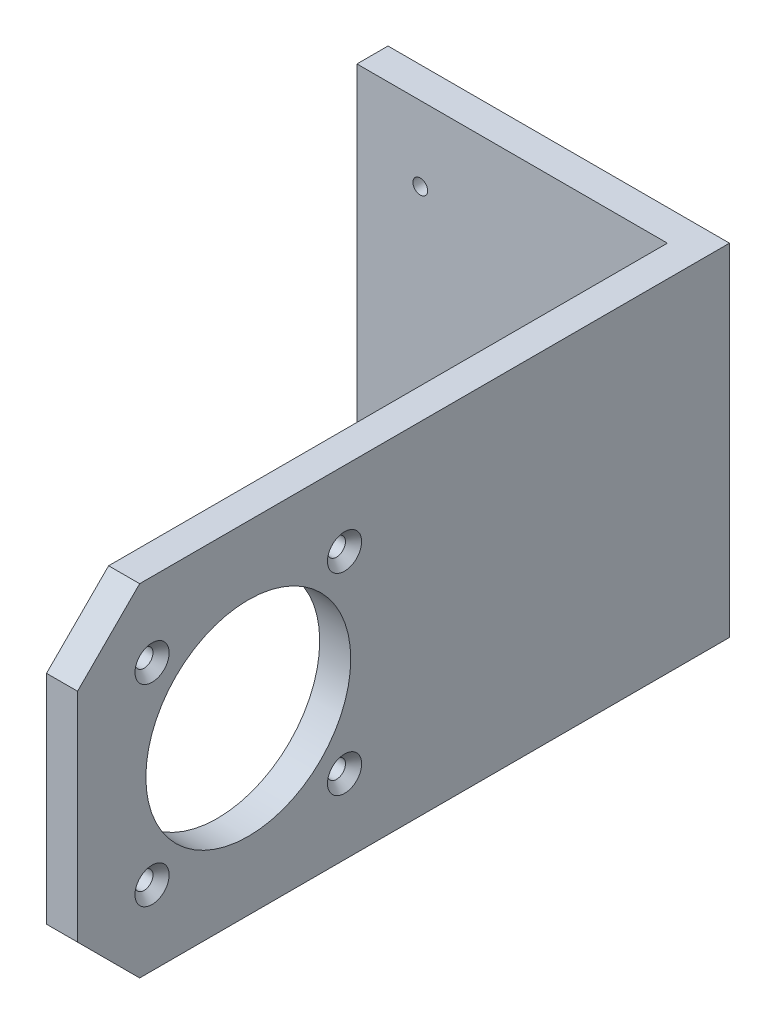
ISO-10303-21;
HEADER;
FILE_DESCRIPTION(('STEP AP214'),'2;1');
FILE_NAME('part.step','',(''),(''),'','','');
FILE_SCHEMA(('AUTOMOTIVE_DESIGN { 1 0 10303 214 1 1 1 1 }'));
ENDSEC;
DATA;
#1=APPLICATION_CONTEXT('core data for automotive mechanical design processes');
#2=APPLICATION_PROTOCOL_DEFINITION('international standard','automotive_design',2000,#1);
#3=PRODUCT_CONTEXT('',#1,'mechanical');
#4=PRODUCT('Part','Part','',(#3));
#5=PRODUCT_RELATED_PRODUCT_CATEGORY('part','',(#4));
#6=PRODUCT_DEFINITION_FORMATION('','',#4);
#7=PRODUCT_DEFINITION_CONTEXT('part definition',#1,'design');
#8=PRODUCT_DEFINITION('design','',#6,#7);
#9=PRODUCT_DEFINITION_SHAPE('','',#8);
#10=(LENGTH_UNIT() NAMED_UNIT(*) SI_UNIT(.MILLI.,.METRE.));
#11=(NAMED_UNIT(*) PLANE_ANGLE_UNIT() SI_UNIT($,.RADIAN.));
#12=(NAMED_UNIT(*) SI_UNIT($,.STERADIAN.) SOLID_ANGLE_UNIT());
#13=UNCERTAINTY_MEASURE_WITH_UNIT(LENGTH_MEASURE(1.E-05),#10,'distance_accuracy_value','');
#14=(GEOMETRIC_REPRESENTATION_CONTEXT(3) GLOBAL_UNCERTAINTY_ASSIGNED_CONTEXT((#13)) GLOBAL_UNIT_ASSIGNED_CONTEXT((#10,
#11,#12)) REPRESENTATION_CONTEXT('',''));
#15=CARTESIAN_POINT('',(0.,0.,0.));
#16=DIRECTION('',(0.,0.,1.));
#17=DIRECTION('',(1.,0.,0.));
#18=AXIS2_PLACEMENT_3D('',#15,#16,#17);
#19=CARTESIAN_POINT('',(27.5,27.5,5.));
#20=DIRECTION('',(-1.,0.,0.));
#21=DIRECTION('',(0.,-1.,0.));
#22=AXIS2_PLACEMENT_3D('',#19,#20,#21);
#23=PLANE('',#22);
#24=CARTESIAN_POINT('',(27.5,15.5,62.));
#25=DIRECTION('',(1.,0.,0.));
#26=DIRECTION('',(0.,0.,-1.));
#27=AXIS2_PLACEMENT_3D('',#24,#25,#26);
#28=CIRCLE('',#27,2.75);
#29=CARTESIAN_POINT('',(27.5,15.5,59.25));
#30=VERTEX_POINT('',#29);
#31=EDGE_CURVE('E228',#30,#30,#28,.T.);
#32=ORIENTED_EDGE('',*,*,#31,.F.);
#33=EDGE_LOOP('',(#32));
#34=FACE_BOUND('',#33,.T.);
#35=CARTESIAN_POINT('',(27.5,-15.5,62.));
#36=DIRECTION('',(1.,0.,0.));
#37=DIRECTION('',(0.,0.,-1.));
#38=AXIS2_PLACEMENT_3D('',#35,#36,#37);
#39=CIRCLE('',#38,2.75);
#40=CARTESIAN_POINT('',(27.5,-15.5,59.25));
#41=VERTEX_POINT('',#40);
#42=EDGE_CURVE('E232',#41,#41,#39,.T.);
#43=ORIENTED_EDGE('',*,*,#42,.F.);
#44=EDGE_LOOP('',(#43));
#45=FACE_BOUND('',#44,.T.);
#46=CARTESIAN_POINT('',(27.5,-15.5,93.));
#47=DIRECTION('',(1.,0.,0.));
#48=DIRECTION('',(0.,0.,-1.));
#49=AXIS2_PLACEMENT_3D('',#46,#47,#48);
#50=CIRCLE('',#49,2.75);
#51=CARTESIAN_POINT('',(27.5,-15.5,90.25));
#52=VERTEX_POINT('',#51);
#53=EDGE_CURVE('E236',#52,#52,#50,.T.);
#54=ORIENTED_EDGE('',*,*,#53,.F.);
#55=EDGE_LOOP('',(#54));
#56=FACE_BOUND('',#55,.T.);
#57=CARTESIAN_POINT('',(27.5,0.,77.5));
#58=DIRECTION('',(1.,0.,0.));
#59=DIRECTION('',(0.,1.,0.));
#60=AXIS2_PLACEMENT_3D('',#57,#58,#59);
#61=CIRCLE('',#60,16.5);
#62=CARTESIAN_POINT('',(27.5,16.5,77.5));
#63=VERTEX_POINT('',#62);
#64=EDGE_CURVE('E148',#63,#63,#61,.T.);
#65=ORIENTED_EDGE('',*,*,#64,.F.);
#66=EDGE_LOOP('',(#65));
#67=FACE_BOUND('',#66,.T.);
#68=DIRECTION('',(0.,1.,0.));
#69=VECTOR('',#68,1.);
#70=CARTESIAN_POINT('',(27.5,27.5,105.));
#71=LINE('',#70,#69);
#72=CARTESIAN_POINT('',(27.5,-17.5,105.));
#73=VERTEX_POINT('',#72);
#74=CARTESIAN_POINT('',(27.5,17.5,105.));
#75=VERTEX_POINT('',#74);
#76=EDGE_CURVE('E155',#73,#75,#71,.T.);
#77=ORIENTED_EDGE('',*,*,#76,.F.);
#78=DIRECTION('',(0.,0.707106781186551,0.707106781186544));
#79=VECTOR('',#78,1.);
#80=CARTESIAN_POINT('',(27.5,-27.5,95.0000000000001));
#81=LINE('',#80,#79);
#82=CARTESIAN_POINT('',(27.5,-27.5,95.0000000000001));
#83=VERTEX_POINT('',#82);
#84=EDGE_CURVE('E50',#83,#73,#81,.T.);
#85=ORIENTED_EDGE('',*,*,#84,.F.);
#86=DIRECTION('',(0.,0.,-1.));
#87=VECTOR('',#86,1.);
#88=CARTESIAN_POINT('',(27.5,-27.5,5.));
#89=LINE('',#88,#87);
#90=CARTESIAN_POINT('',(27.5,-27.5,0.));
#91=VERTEX_POINT('',#90);
#92=EDGE_CURVE('E196',#83,#91,#89,.T.);
#93=ORIENTED_EDGE('',*,*,#92,.T.);
#94=DIRECTION('',(0.,1.,0.));
#95=VECTOR('',#94,1.);
#96=CARTESIAN_POINT('',(27.5,27.5,0.));
#97=LINE('',#96,#95);
#98=CARTESIAN_POINT('',(27.5,27.5,0.));
#99=VERTEX_POINT('',#98);
#100=EDGE_CURVE('E174',#91,#99,#97,.T.);
#101=ORIENTED_EDGE('',*,*,#100,.T.);
#102=DIRECTION('',(0.,0.,-1.));
#103=VECTOR('',#102,1.);
#104=CARTESIAN_POINT('',(27.5,27.5,5.));
#105=LINE('',#104,#103);
#106=CARTESIAN_POINT('',(27.5,27.5,94.9999999999999));
#107=VERTEX_POINT('',#106);
#108=EDGE_CURVE('E11',#107,#99,#105,.T.);
#109=ORIENTED_EDGE('',*,*,#108,.F.);
#110=DIRECTION('',(0.,0.707106781186544,-0.707106781186551));
#111=VECTOR('',#110,1.);
#112=CARTESIAN_POINT('',(27.5,27.5,94.9999999999999));
#113=LINE('',#112,#111);
#114=EDGE_CURVE('E133',#75,#107,#113,.T.);
#115=ORIENTED_EDGE('',*,*,#114,.F.);
#116=EDGE_LOOP('',(#77,#85,#93,#101,#109,#115));
#117=FACE_BOUND('',#116,.T.);
#118=CARTESIAN_POINT('',(27.5,15.5,93.));
#119=DIRECTION('',(1.,0.,0.));
#120=DIRECTION('',(0.,0.,-1.));
#121=AXIS2_PLACEMENT_3D('',#118,#119,#120);
#122=CIRCLE('',#121,2.75);
#123=CARTESIAN_POINT('',(27.5,15.5,90.25));
#124=VERTEX_POINT('',#123);
#125=EDGE_CURVE('E244',#124,#124,#122,.T.);
#126=ORIENTED_EDGE('',*,*,#125,.F.);
#127=EDGE_LOOP('',(#126));
#128=FACE_BOUND('',#127,.T.);
#129=ADVANCED_FACE('F33',(#34,#45,#56,#67,#117,#128),#23,.F.);
#130=CARTESIAN_POINT('',(-27.5,27.5,5.));
#131=DIRECTION('',(0.,-1.,0.));
#132=DIRECTION('',(0.,0.,-1.));
#133=AXIS2_PLACEMENT_3D('',#130,#131,#132);
#134=PLANE('',#133);
#135=DIRECTION('',(0.,0.,-1.));
#136=VECTOR('',#135,1.);
#137=CARTESIAN_POINT('',(22.5,27.5,105.));
#138=LINE('',#137,#136);
#139=CARTESIAN_POINT('',(22.5,27.5,94.9999999999999));
#140=VERTEX_POINT('',#139);
#141=CARTESIAN_POINT('',(22.5,27.5,5.));
#142=VERTEX_POINT('',#141);
#143=EDGE_CURVE('E173',#140,#142,#138,.T.);
#144=ORIENTED_EDGE('',*,*,#143,.F.);
#145=DIRECTION('',(1.,0.,0.));
#146=VECTOR('',#145,1.);
#147=CARTESIAN_POINT('',(-27.501025,27.5,94.9999999999999));
#148=LINE('',#147,#146);
#149=EDGE_CURVE('E137',#140,#107,#148,.T.);
#150=ORIENTED_EDGE('',*,*,#149,.T.);
#151=ORIENTED_EDGE('',*,*,#108,.T.);
#152=DIRECTION('',(-1.,0.,0.));
#153=VECTOR('',#152,1.);
#154=CARTESIAN_POINT('',(-27.5,27.5,0.));
#155=LINE('',#154,#153);
#156=CARTESIAN_POINT('',(-27.5,27.5,0.));
#157=VERTEX_POINT('',#156);
#158=EDGE_CURVE('E179',#99,#157,#155,.T.);
#159=ORIENTED_EDGE('',*,*,#158,.T.);
#160=DIRECTION('',(0.,0.,-1.));
#161=VECTOR('',#160,1.);
#162=CARTESIAN_POINT('',(-27.5,27.5,5.));
#163=LINE('',#162,#161);
#164=CARTESIAN_POINT('',(-27.5,27.5,5.));
#165=VERTEX_POINT('',#164);
#166=EDGE_CURVE('E42',#165,#157,#163,.T.);
#167=ORIENTED_EDGE('',*,*,#166,.F.);
#168=DIRECTION('',(-1.,0.,0.));
#169=VECTOR('',#168,1.);
#170=CARTESIAN_POINT('',(-27.5,27.5,5.));
#171=LINE('',#170,#169);
#172=EDGE_CURVE('E508',#142,#165,#171,.T.);
#173=ORIENTED_EDGE('',*,*,#172,.F.);
#174=EDGE_LOOP('',(#144,#150,#151,#159,#167,#173));
#175=FACE_BOUND('',#174,.T.);
#176=ADVANCED_FACE('F217',(#175),#134,.F.);
#177=CARTESIAN_POINT('',(-27.5,27.5,5.));
#178=DIRECTION('',(1.,0.,0.));
#179=DIRECTION('',(0.,1.,0.));
#180=AXIS2_PLACEMENT_3D('',#177,#178,#179);
#181=PLANE('',#180);
#182=DIRECTION('',(0.,-1.,0.));
#183=VECTOR('',#182,1.);
#184=CARTESIAN_POINT('',(-27.5,27.5,0.));
#185=LINE('',#184,#183);
#186=CARTESIAN_POINT('',(-27.5,-27.5,0.));
#187=VERTEX_POINT('',#186);
#188=EDGE_CURVE('E497',#157,#187,#185,.T.);
#189=ORIENTED_EDGE('',*,*,#188,.T.);
#190=DIRECTION('',(0.,0.,-1.));
#191=VECTOR('',#190,1.);
#192=CARTESIAN_POINT('',(-27.5,-27.5,5.));
#193=LINE('',#192,#191);
#194=CARTESIAN_POINT('',(-27.5,-27.5,5.));
#195=VERTEX_POINT('',#194);
#196=EDGE_CURVE('E498',#195,#187,#193,.T.);
#197=ORIENTED_EDGE('',*,*,#196,.F.);
#198=DIRECTION('',(0.,-1.,0.));
#199=VECTOR('',#198,1.);
#200=CARTESIAN_POINT('',(-27.5,27.5,5.));
#201=LINE('',#200,#199);
#202=EDGE_CURVE('E194',#165,#195,#201,.T.);
#203=ORIENTED_EDGE('',*,*,#202,.F.);
#204=ORIENTED_EDGE('',*,*,#166,.T.);
#205=EDGE_LOOP('',(#189,#197,#203,#204));
#206=FACE_BOUND('',#205,.T.);
#207=ADVANCED_FACE('F223',(#206),#181,.F.);
#208=CARTESIAN_POINT('',(-27.5,-27.5,5.));
#209=DIRECTION('',(0.,1.,0.));
#210=DIRECTION('',(0.,0.,1.));
#211=AXIS2_PLACEMENT_3D('',#208,#209,#210);
#212=PLANE('',#211);
#213=ORIENTED_EDGE('',*,*,#92,.F.);
#214=DIRECTION('',(1.,0.,0.));
#215=VECTOR('',#214,1.);
#216=CARTESIAN_POINT('',(-27.501025,-27.5,95.0000000000001));
#217=LINE('',#216,#215);
#218=CARTESIAN_POINT('',(22.5,-27.5,95.0000000000001));
#219=VERTEX_POINT('',#218);
#220=EDGE_CURVE('E130',#219,#83,#217,.T.);
#221=ORIENTED_EDGE('',*,*,#220,.F.);
#222=DIRECTION('',(0.,0.,-1.));
#223=VECTOR('',#222,1.);
#224=CARTESIAN_POINT('',(22.5,-27.5,105.));
#225=LINE('',#224,#223);
#226=CARTESIAN_POINT('',(22.5,-27.5,5.));
#227=VERTEX_POINT('',#226);
#228=EDGE_CURVE('E36',#219,#227,#225,.T.);
#229=ORIENTED_EDGE('',*,*,#228,.T.);
#230=DIRECTION('',(1.,0.,0.));
#231=VECTOR('',#230,1.);
#232=CARTESIAN_POINT('',(-27.5,-27.5,5.));
#233=LINE('',#232,#231);
#234=EDGE_CURVE('E167',#195,#227,#233,.T.);
#235=ORIENTED_EDGE('',*,*,#234,.F.);
#236=ORIENTED_EDGE('',*,*,#196,.T.);
#237=DIRECTION('',(1.,0.,0.));
#238=VECTOR('',#237,1.);
#239=CARTESIAN_POINT('',(-27.5,-27.5,0.));
#240=LINE('',#239,#238);
#241=EDGE_CURVE('E503',#187,#91,#240,.T.);
#242=ORIENTED_EDGE('',*,*,#241,.T.);
#243=EDGE_LOOP('',(#213,#221,#229,#235,#236,#242));
#244=FACE_BOUND('',#243,.T.);
#245=ADVANCED_FACE('F187',(#244),#212,.F.);
#246=CARTESIAN_POINT('',(0.,0.,5.));
#247=DIRECTION('',(0.,0.,1.));
#248=DIRECTION('',(1.,0.,0.));
#249=AXIS2_PLACEMENT_3D('',#246,#247,#248);
#250=PLANE('',#249);
#251=CARTESIAN_POINT('',(-17.3,15.5,5.));
#252=DIRECTION('',(0.,0.,1.));
#253=DIRECTION('',(1.,0.,0.));
#254=AXIS2_PLACEMENT_3D('',#251,#252,#253);
#255=CIRCLE('',#254,1.18744999999999);
#256=CARTESIAN_POINT('',(-16.11255,15.5,5.));
#257=VERTEX_POINT('',#256);
#258=EDGE_CURVE('E115',#257,#257,#255,.T.);
#259=ORIENTED_EDGE('',*,*,#258,.F.);
#260=EDGE_LOOP('',(#259));
#261=FACE_BOUND('',#260,.T.);
#262=CARTESIAN_POINT('',(-17.3,-15.5,5.));
#263=DIRECTION('',(0.,0.,1.));
#264=DIRECTION('',(1.,0.,0.));
#265=AXIS2_PLACEMENT_3D('',#262,#263,#264);
#266=CIRCLE('',#265,1.18744999999999);
#267=CARTESIAN_POINT('',(-16.11255,-15.5,5.));
#268=VERTEX_POINT('',#267);
#269=EDGE_CURVE('E114',#268,#268,#266,.T.);
#270=ORIENTED_EDGE('',*,*,#269,.F.);
#271=EDGE_LOOP('',(#270));
#272=FACE_BOUND('',#271,.T.);
#273=CARTESIAN_POINT('',(0.,0.,5.));
#274=DIRECTION('',(0.,0.,1.));
#275=DIRECTION('',(1.,0.,0.));
#276=AXIS2_PLACEMENT_3D('',#273,#274,#275);
#277=CIRCLE('',#276,2.5);
#278=CARTESIAN_POINT('',(2.5,0.,5.));
#279=VERTEX_POINT('',#278);
#280=EDGE_CURVE('E142',#279,#279,#277,.T.);
#281=ORIENTED_EDGE('',*,*,#280,.F.);
#282=EDGE_LOOP('',(#281));
#283=FACE_BOUND('',#282,.T.);
#284=DIRECTION('',(0.,-1.,0.));
#285=VECTOR('',#284,1.);
#286=CARTESIAN_POINT('',(22.5,27.5,5.));
#287=LINE('',#286,#285);
#288=EDGE_CURVE('E154',#142,#227,#287,.T.);
#289=ORIENTED_EDGE('',*,*,#288,.F.);
#290=ORIENTED_EDGE('',*,*,#172,.T.);
#291=ORIENTED_EDGE('',*,*,#202,.T.);
#292=ORIENTED_EDGE('',*,*,#234,.T.);
#293=EDGE_LOOP('',(#289,#290,#291,#292));
#294=FACE_BOUND('',#293,.T.);
#295=ADVANCED_FACE('F191',(#261,#272,#283,#294),#250,.T.);
#296=CARTESIAN_POINT('',(0.,0.,0.));
#297=DIRECTION('',(0.,0.,1.));
#298=DIRECTION('',(1.,0.,0.));
#299=AXIS2_PLACEMENT_3D('',#296,#297,#298);
#300=PLANE('',#299);
#301=CARTESIAN_POINT('',(0.,0.,0.));
#302=DIRECTION('',(0.,0.,1.));
#303=DIRECTION('',(1.,0.,0.));
#304=AXIS2_PLACEMENT_3D('',#301,#302,#303);
#305=CIRCLE('',#304,2.5);
#306=CARTESIAN_POINT('',(2.5,0.,0.));
#307=VERTEX_POINT('',#306);
#308=EDGE_CURVE('E145',#307,#307,#305,.F.);
#309=ORIENTED_EDGE('',*,*,#308,.F.);
#310=EDGE_LOOP('',(#309));
#311=FACE_BOUND('',#310,.T.);
#312=ORIENTED_EDGE('',*,*,#100,.F.);
#313=ORIENTED_EDGE('',*,*,#241,.F.);
#314=ORIENTED_EDGE('',*,*,#188,.F.);
#315=ORIENTED_EDGE('',*,*,#158,.F.);
#316=EDGE_LOOP('',(#312,#313,#314,#315));
#317=FACE_BOUND('',#316,.T.);
#318=ADVANCED_FACE('F200',(#311,#317),#300,.F.);
#319=CARTESIAN_POINT('',(22.5,27.5,105.));
#320=DIRECTION('',(1.,0.,0.));
#321=DIRECTION('',(0.,1.,0.));
#322=AXIS2_PLACEMENT_3D('',#319,#320,#321);
#323=PLANE('',#322);
#324=CARTESIAN_POINT('',(22.5,15.5,93.));
#325=DIRECTION('',(1.,0.,0.));
#326=DIRECTION('',(0.,1.,0.));
#327=AXIS2_PLACEMENT_3D('',#324,#325,#326);
#328=CIRCLE('',#327,1.45);
#329=CARTESIAN_POINT('',(22.5,16.95,93.));
#330=VERTEX_POINT('',#329);
#331=EDGE_CURVE('E249',#330,#330,#328,.T.);
#332=ORIENTED_EDGE('',*,*,#331,.T.);
#333=EDGE_LOOP('',(#332));
#334=FACE_BOUND('',#333,.T.);
#335=CARTESIAN_POINT('',(22.5,15.5,62.));
#336=DIRECTION('',(1.,0.,0.));
#337=DIRECTION('',(0.,1.,0.));
#338=AXIS2_PLACEMENT_3D('',#335,#336,#337);
#339=CIRCLE('',#338,1.45);
#340=CARTESIAN_POINT('',(22.5,16.95,62.));
#341=VERTEX_POINT('',#340);
#342=EDGE_CURVE('E257',#341,#341,#339,.T.);
#343=ORIENTED_EDGE('',*,*,#342,.T.);
#344=EDGE_LOOP('',(#343));
#345=FACE_BOUND('',#344,.T.);
#346=CARTESIAN_POINT('',(22.5,-15.5,62.));
#347=DIRECTION('',(1.,0.,0.));
#348=DIRECTION('',(0.,1.,0.));
#349=AXIS2_PLACEMENT_3D('',#346,#347,#348);
#350=CIRCLE('',#349,1.45);
#351=CARTESIAN_POINT('',(22.5,-14.05,62.));
#352=VERTEX_POINT('',#351);
#353=EDGE_CURVE('E264',#352,#352,#350,.T.);
#354=ORIENTED_EDGE('',*,*,#353,.T.);
#355=EDGE_LOOP('',(#354));
#356=FACE_BOUND('',#355,.T.);
#357=CARTESIAN_POINT('',(22.5,-15.5,93.));
#358=DIRECTION('',(1.,0.,0.));
#359=DIRECTION('',(0.,1.,0.));
#360=AXIS2_PLACEMENT_3D('',#357,#358,#359);
#361=CIRCLE('',#360,1.45);
#362=CARTESIAN_POINT('',(22.5,-14.05,93.));
#363=VERTEX_POINT('',#362);
#364=EDGE_CURVE('E121',#363,#363,#361,.T.);
#365=ORIENTED_EDGE('',*,*,#364,.T.);
#366=EDGE_LOOP('',(#365));
#367=FACE_BOUND('',#366,.T.);
#368=CARTESIAN_POINT('',(22.5,0.,77.5));
#369=DIRECTION('',(1.,0.,0.));
#370=DIRECTION('',(0.,1.,0.));
#371=AXIS2_PLACEMENT_3D('',#368,#369,#370);
#372=CIRCLE('',#371,16.5);
#373=CARTESIAN_POINT('',(22.5,16.5,77.5));
#374=VERTEX_POINT('',#373);
#375=EDGE_CURVE('E151',#374,#374,#372,.F.);
#376=ORIENTED_EDGE('',*,*,#375,.F.);
#377=EDGE_LOOP('',(#376));
#378=FACE_BOUND('',#377,.T.);
#379=ORIENTED_EDGE('',*,*,#228,.F.);
#380=DIRECTION('',(0.,-0.707106781186551,-0.707106781186544));
#381=VECTOR('',#380,1.);
#382=CARTESIAN_POINT('',(22.5,-27.5,95.0000000000001));
#383=LINE('',#382,#381);
#384=CARTESIAN_POINT('',(22.5,-17.5,105.));
#385=VERTEX_POINT('',#384);
#386=EDGE_CURVE('E127',#385,#219,#383,.T.);
#387=ORIENTED_EDGE('',*,*,#386,.F.);
#388=DIRECTION('',(0.,-1.,0.));
#389=VECTOR('',#388,1.);
#390=CARTESIAN_POINT('',(22.5,27.5,105.));
#391=LINE('',#390,#389);
#392=CARTESIAN_POINT('',(22.5,17.5,105.));
#393=VERTEX_POINT('',#392);
#394=EDGE_CURVE('E157',#393,#385,#391,.T.);
#395=ORIENTED_EDGE('',*,*,#394,.F.);
#396=DIRECTION('',(0.,-0.707106781186544,0.707106781186551));
#397=VECTOR('',#396,1.);
#398=CARTESIAN_POINT('',(22.5,27.5,94.9999999999999));
#399=LINE('',#398,#397);
#400=EDGE_CURVE('E58',#140,#393,#399,.T.);
#401=ORIENTED_EDGE('',*,*,#400,.F.);
#402=ORIENTED_EDGE('',*,*,#143,.T.);
#403=ORIENTED_EDGE('',*,*,#288,.T.);
#404=EDGE_LOOP('',(#379,#387,#395,#401,#402,#403));
#405=FACE_BOUND('',#404,.T.);
#406=ADVANCED_FACE('F197',(#334,#345,#356,#367,#378,#405),#323,.F.);
#407=CARTESIAN_POINT('',(0.,0.,105.));
#408=DIRECTION('',(0.,0.,-1.));
#409=DIRECTION('',(-1.,0.,0.));
#410=AXIS2_PLACEMENT_3D('',#407,#408,#409);
#411=PLANE('',#410);
#412=ORIENTED_EDGE('',*,*,#394,.T.);
#413=DIRECTION('',(1.,0.,0.));
#414=VECTOR('',#413,1.);
#415=CARTESIAN_POINT('',(-27.501025,-17.5,105.));
#416=LINE('',#415,#414);
#417=EDGE_CURVE('E131',#385,#73,#416,.T.);
#418=ORIENTED_EDGE('',*,*,#417,.T.);
#419=ORIENTED_EDGE('',*,*,#76,.T.);
#420=DIRECTION('',(1.,0.,0.));
#421=VECTOR('',#420,1.);
#422=CARTESIAN_POINT('',(-27.501025,17.5,105.));
#423=LINE('',#422,#421);
#424=EDGE_CURVE('E136',#393,#75,#423,.T.);
#425=ORIENTED_EDGE('',*,*,#424,.F.);
#426=EDGE_LOOP('',(#412,#418,#419,#425));
#427=FACE_BOUND('',#426,.T.);
#428=ADVANCED_FACE('F199',(#427),#411,.F.);
#429=CARTESIAN_POINT('',(-27.501025,0.,77.5));
#430=DIRECTION('',(1.,0.,0.));
#431=DIRECTION('',(0.,1.,0.));
#432=AXIS2_PLACEMENT_3D('',#429,#430,#431);
#433=CYLINDRICAL_SURFACE('',#432,16.5);
#434=ORIENTED_EDGE('',*,*,#64,.T.);
#435=EDGE_LOOP('',(#434));
#436=FACE_BOUND('',#435,.T.);
#437=ORIENTED_EDGE('',*,*,#375,.T.);
#438=EDGE_LOOP('',(#437));
#439=FACE_BOUND('',#438,.T.);
#440=ADVANCED_FACE('F208',(#436,#439),#433,.F.);
#441=CARTESIAN_POINT('',(0.,0.,-0.00100000000000013));
#442=DIRECTION('',(0.,0.,1.));
#443=DIRECTION('',(1.,0.,0.));
#444=AXIS2_PLACEMENT_3D('',#441,#442,#443);
#445=CYLINDRICAL_SURFACE('',#444,2.5);
#446=ORIENTED_EDGE('',*,*,#280,.T.);
#447=EDGE_LOOP('',(#446));
#448=FACE_BOUND('',#447,.T.);
#449=ORIENTED_EDGE('',*,*,#308,.T.);
#450=EDGE_LOOP('',(#449));
#451=FACE_BOUND('',#450,.T.);
#452=ADVANCED_FACE('F309',(#448,#451),#445,.F.);
#453=CARTESIAN_POINT('',(-27.501025,27.5,94.9999999999999));
#454=DIRECTION('',(0.,-0.707106781186551,-0.707106781186544));
#455=DIRECTION('',(0.,0.707106781186544,-0.707106781186551));
#456=AXIS2_PLACEMENT_3D('',#453,#454,#455);
#457=PLANE('',#456);
#458=ORIENTED_EDGE('',*,*,#400,.T.);
#459=ORIENTED_EDGE('',*,*,#424,.T.);
#460=ORIENTED_EDGE('',*,*,#114,.T.);
#461=ORIENTED_EDGE('',*,*,#149,.F.);
#462=EDGE_LOOP('',(#458,#459,#460,#461));
#463=FACE_BOUND('',#462,.T.);
#464=ADVANCED_FACE('F306',(#463),#457,.F.);
#465=CARTESIAN_POINT('',(-27.501025,-27.5,95.0000000000001));
#466=DIRECTION('',(0.,0.707106781186544,-0.707106781186551));
#467=DIRECTION('',(0.,0.707106781186551,0.707106781186544));
#468=AXIS2_PLACEMENT_3D('',#465,#466,#467);
#469=PLANE('',#468);
#470=ORIENTED_EDGE('',*,*,#386,.T.);
#471=ORIENTED_EDGE('',*,*,#220,.T.);
#472=ORIENTED_EDGE('',*,*,#84,.T.);
#473=ORIENTED_EDGE('',*,*,#417,.F.);
#474=EDGE_LOOP('',(#470,#471,#472,#473));
#475=FACE_BOUND('',#474,.T.);
#476=ADVANCED_FACE('F302',(#475),#469,.F.);
#477=CARTESIAN_POINT('',(-17.3,-15.5,1.5));
#478=DIRECTION('',(0.,0.,1.));
#479=DIRECTION('',(1.,0.,0.));
#480=AXIS2_PLACEMENT_3D('',#477,#478,#479);
#481=CONICAL_SURFACE('',#480,1.18745,1.02974425867665);
#482=CARTESIAN_POINT('',(-17.3,-15.5,0.786508057935724));
#483=VERTEX_POINT('',#482);
#484=VERTEX_LOOP('',#483);
#485=FACE_BOUND('',#484,.T.);
#486=CARTESIAN_POINT('',(-17.3,-15.5,1.5));
#487=DIRECTION('',(0.,0.,1.));
#488=DIRECTION('',(1.,0.,0.));
#489=AXIS2_PLACEMENT_3D('',#486,#487,#488);
#490=CIRCLE('',#489,1.18745);
#491=CARTESIAN_POINT('',(-16.11255,-15.5,1.5));
#492=VERTEX_POINT('',#491);
#493=EDGE_CURVE('E118',#492,#492,#490,.T.);
#494=ORIENTED_EDGE('',*,*,#493,.T.);
#495=EDGE_LOOP('',(#494));
#496=FACE_BOUND('',#495,.T.);
#497=ADVANCED_FACE('F298',(#485,#496),#481,.F.);
#498=CARTESIAN_POINT('',(-17.3,-15.5,5.));
#499=DIRECTION('',(0.,0.,1.));
#500=DIRECTION('',(1.,0.,0.));
#501=AXIS2_PLACEMENT_3D('',#498,#499,#500);
#502=CYLINDRICAL_SURFACE('',#501,1.18744999999999);
#503=ORIENTED_EDGE('',*,*,#493,.F.);
#504=EDGE_LOOP('',(#503));
#505=FACE_BOUND('',#504,.T.);
#506=ORIENTED_EDGE('',*,*,#269,.T.);
#507=EDGE_LOOP('',(#506));
#508=FACE_BOUND('',#507,.T.);
#509=ADVANCED_FACE('F108',(#505,#508),#502,.F.);
#510=CARTESIAN_POINT('',(-17.3,15.5,1.5));
#511=DIRECTION('',(0.,0.,1.));
#512=DIRECTION('',(1.,0.,0.));
#513=AXIS2_PLACEMENT_3D('',#510,#511,#512);
#514=CONICAL_SURFACE('',#513,1.18745,1.02974425867665);
#515=CARTESIAN_POINT('',(-17.3,15.5,0.786508057935724));
#516=VERTEX_POINT('',#515);
#517=VERTEX_LOOP('',#516);
#518=FACE_BOUND('',#517,.T.);
#519=CARTESIAN_POINT('',(-17.3,15.5,1.5));
#520=DIRECTION('',(0.,0.,1.));
#521=DIRECTION('',(1.,0.,0.));
#522=AXIS2_PLACEMENT_3D('',#519,#520,#521);
#523=CIRCLE('',#522,1.18745);
#524=CARTESIAN_POINT('',(-16.11255,15.5,1.5));
#525=VERTEX_POINT('',#524);
#526=EDGE_CURVE('E112',#525,#525,#523,.T.);
#527=ORIENTED_EDGE('',*,*,#526,.T.);
#528=EDGE_LOOP('',(#527));
#529=FACE_BOUND('',#528,.T.);
#530=ADVANCED_FACE('F104',(#518,#529),#514,.F.);
#531=CARTESIAN_POINT('',(-17.3,15.5,5.));
#532=DIRECTION('',(0.,0.,1.));
#533=DIRECTION('',(1.,0.,0.));
#534=AXIS2_PLACEMENT_3D('',#531,#532,#533);
#535=CYLINDRICAL_SURFACE('',#534,1.18744999999999);
#536=ORIENTED_EDGE('',*,*,#526,.F.);
#537=EDGE_LOOP('',(#536));
#538=FACE_BOUND('',#537,.T.);
#539=ORIENTED_EDGE('',*,*,#258,.T.);
#540=EDGE_LOOP('',(#539));
#541=FACE_BOUND('',#540,.T.);
#542=ADVANCED_FACE('F107',(#538,#541),#535,.F.);
#543=CARTESIAN_POINT('',(27.5,-15.5,93.));
#544=DIRECTION('',(1.,0.,0.));
#545=DIRECTION('',(0.,0.,-1.));
#546=AXIS2_PLACEMENT_3D('',#543,#544,#545);
#547=CYLINDRICAL_SURFACE('',#546,1.45);
#548=ORIENTED_EDGE('',*,*,#364,.F.);
#549=EDGE_LOOP('',(#548));
#550=FACE_BOUND('',#549,.T.);
#551=CARTESIAN_POINT('',(26.2,-15.5,93.));
#552=DIRECTION('',(1.,0.,0.));
#553=DIRECTION('',(0.,0.,-1.));
#554=AXIS2_PLACEMENT_3D('',#551,#552,#553);
#555=CIRCLE('',#554,1.45);
#556=CARTESIAN_POINT('',(26.2,-15.5,91.55));
#557=VERTEX_POINT('',#556);
#558=EDGE_CURVE('E268',#557,#557,#555,.T.);
#559=ORIENTED_EDGE('',*,*,#558,.T.);
#560=EDGE_LOOP('',(#559));
#561=FACE_BOUND('',#560,.T.);
#562=ADVANCED_FACE('F275',(#550,#561),#547,.F.);
#563=CARTESIAN_POINT('',(27.5,-15.5,93.));
#564=DIRECTION('',(1.,0.,0.));
#565=DIRECTION('',(0.,0.,-1.));
#566=AXIS2_PLACEMENT_3D('',#563,#564,#565);
#567=CONICAL_SURFACE('',#566,2.75,0.785398163397448);
#568=ORIENTED_EDGE('',*,*,#558,.F.);
#569=EDGE_LOOP('',(#568));
#570=FACE_BOUND('',#569,.T.);
#571=ORIENTED_EDGE('',*,*,#53,.T.);
#572=EDGE_LOOP('',(#571));
#573=FACE_BOUND('',#572,.T.);
#574=ADVANCED_FACE('F278',(#570,#573),#567,.F.);
#575=CARTESIAN_POINT('',(27.5,-15.5,62.));
#576=DIRECTION('',(1.,0.,0.));
#577=DIRECTION('',(0.,0.,-1.));
#578=AXIS2_PLACEMENT_3D('',#575,#576,#577);
#579=CYLINDRICAL_SURFACE('',#578,1.45);
#580=ORIENTED_EDGE('',*,*,#353,.F.);
#581=EDGE_LOOP('',(#580));
#582=FACE_BOUND('',#581,.T.);
#583=CARTESIAN_POINT('',(26.2,-15.5,62.));
#584=DIRECTION('',(1.,0.,0.));
#585=DIRECTION('',(0.,0.,-1.));
#586=AXIS2_PLACEMENT_3D('',#583,#584,#585);
#587=CIRCLE('',#586,1.45);
#588=CARTESIAN_POINT('',(26.2,-15.5,60.55));
#589=VERTEX_POINT('',#588);
#590=EDGE_CURVE('E261',#589,#589,#587,.T.);
#591=ORIENTED_EDGE('',*,*,#590,.T.);
#592=EDGE_LOOP('',(#591));
#593=FACE_BOUND('',#592,.T.);
#594=ADVANCED_FACE('F284',(#582,#593),#579,.F.);
#595=CARTESIAN_POINT('',(27.5,-15.5,62.));
#596=DIRECTION('',(1.,0.,0.));
#597=DIRECTION('',(0.,0.,-1.));
#598=AXIS2_PLACEMENT_3D('',#595,#596,#597);
#599=CONICAL_SURFACE('',#598,2.75,0.78539816339745);
#600=ORIENTED_EDGE('',*,*,#590,.F.);
#601=EDGE_LOOP('',(#600));
#602=FACE_BOUND('',#601,.T.);
#603=ORIENTED_EDGE('',*,*,#42,.T.);
#604=EDGE_LOOP('',(#603));
#605=FACE_BOUND('',#604,.T.);
#606=ADVANCED_FACE('F289',(#602,#605),#599,.F.);
#607=CARTESIAN_POINT('',(27.5,15.5,62.));
#608=DIRECTION('',(1.,0.,0.));
#609=DIRECTION('',(0.,0.,-1.));
#610=AXIS2_PLACEMENT_3D('',#607,#608,#609);
#611=CYLINDRICAL_SURFACE('',#610,1.45);
#612=ORIENTED_EDGE('',*,*,#342,.F.);
#613=EDGE_LOOP('',(#612));
#614=FACE_BOUND('',#613,.T.);
#615=CARTESIAN_POINT('',(26.2,15.5,62.));
#616=DIRECTION('',(1.,0.,0.));
#617=DIRECTION('',(0.,0.,-1.));
#618=AXIS2_PLACEMENT_3D('',#615,#616,#617);
#619=CIRCLE('',#618,1.45);
#620=CARTESIAN_POINT('',(26.2,15.5,60.55));
#621=VERTEX_POINT('',#620);
#622=EDGE_CURVE('E254',#621,#621,#619,.T.);
#623=ORIENTED_EDGE('',*,*,#622,.T.);
#624=EDGE_LOOP('',(#623));
#625=FACE_BOUND('',#624,.T.);
#626=ADVANCED_FACE('F379',(#614,#625),#611,.F.);
#627=CARTESIAN_POINT('',(27.5,15.5,62.));
#628=DIRECTION('',(1.,0.,0.));
#629=DIRECTION('',(0.,0.,-1.));
#630=AXIS2_PLACEMENT_3D('',#627,#628,#629);
#631=CONICAL_SURFACE('',#630,2.75,0.785398163397448);
#632=ORIENTED_EDGE('',*,*,#622,.F.);
#633=EDGE_LOOP('',(#632));
#634=FACE_BOUND('',#633,.T.);
#635=ORIENTED_EDGE('',*,*,#31,.T.);
#636=EDGE_LOOP('',(#635));
#637=FACE_BOUND('',#636,.T.);
#638=ADVANCED_FACE('F388',(#634,#637),#631,.F.);
#639=CARTESIAN_POINT('',(27.5,15.5,93.));
#640=DIRECTION('',(1.,0.,0.));
#641=DIRECTION('',(0.,0.,-1.));
#642=AXIS2_PLACEMENT_3D('',#639,#640,#641);
#643=CYLINDRICAL_SURFACE('',#642,1.45);
#644=ORIENTED_EDGE('',*,*,#331,.F.);
#645=EDGE_LOOP('',(#644));
#646=FACE_BOUND('',#645,.T.);
#647=CARTESIAN_POINT('',(26.2,15.5,93.));
#648=DIRECTION('',(1.,0.,0.));
#649=DIRECTION('',(0.,0.,-1.));
#650=AXIS2_PLACEMENT_3D('',#647,#648,#649);
#651=CIRCLE('',#650,1.45);
#652=CARTESIAN_POINT('',(26.2,15.5,91.55));
#653=VERTEX_POINT('',#652);
#654=EDGE_CURVE('E246',#653,#653,#651,.T.);
#655=ORIENTED_EDGE('',*,*,#654,.T.);
#656=EDGE_LOOP('',(#655));
#657=FACE_BOUND('',#656,.T.);
#658=ADVANCED_FACE('F398',(#646,#657),#643,.F.);
#659=CARTESIAN_POINT('',(27.5,15.5,93.));
#660=DIRECTION('',(1.,0.,0.));
#661=DIRECTION('',(0.,0.,-1.));
#662=AXIS2_PLACEMENT_3D('',#659,#660,#661);
#663=CONICAL_SURFACE('',#662,2.75,0.785398163397448);
#664=ORIENTED_EDGE('',*,*,#654,.F.);
#665=EDGE_LOOP('',(#664));
#666=FACE_BOUND('',#665,.T.);
#667=ORIENTED_EDGE('',*,*,#125,.T.);
#668=EDGE_LOOP('',(#667));
#669=FACE_BOUND('',#668,.T.);
#670=ADVANCED_FACE('F408',(#666,#669),#663,.F.);
#671=CLOSED_SHELL('',(#129,#176,#207,#245,#295,#318,#406,#428,#440,#452,#464,#476,#497,#509,
#530,#542,#562,#574,#594,#606,#626,#638,#658,#670));
#672=MANIFOLD_SOLID_BREP('B2',#671);
#673=ADVANCED_BREP_SHAPE_REPRESENTATION('',(#18,#672),#14);
#674=SHAPE_DEFINITION_REPRESENTATION(#9,#673);
ENDSEC;
END-ISO-10303-21;
